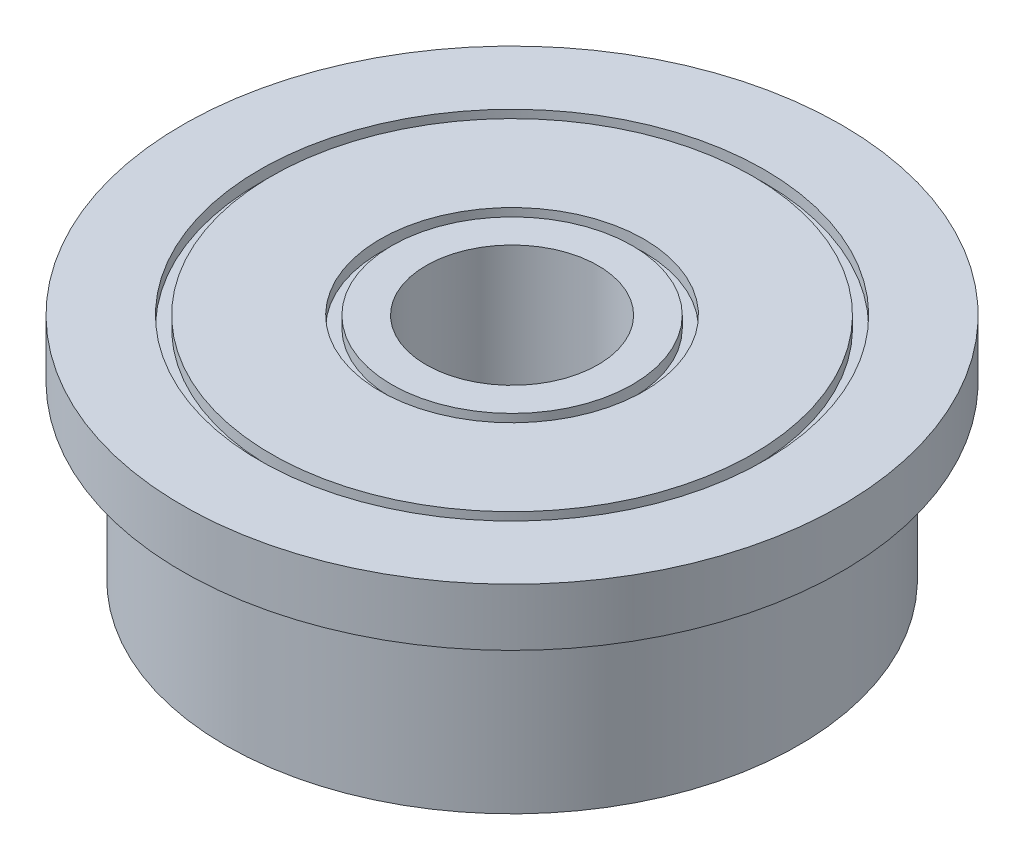
ISO-10303-21;
HEADER;
FILE_DESCRIPTION(('STEP AP214'),'2;1');
FILE_NAME('part.step','',(''),(''),'','','');
FILE_SCHEMA(('AUTOMOTIVE_DESIGN { 1 0 10303 214 1 1 1 1 }'));
ENDSEC;
DATA;
#1=APPLICATION_CONTEXT('core data for automotive mechanical design processes');
#2=APPLICATION_PROTOCOL_DEFINITION('international standard','automotive_design',2000,#1);
#3=PRODUCT_CONTEXT('',#1,'mechanical');
#4=PRODUCT('Part','Part','',(#3));
#5=PRODUCT_RELATED_PRODUCT_CATEGORY('part','',(#4));
#6=PRODUCT_DEFINITION_FORMATION('','',#4);
#7=PRODUCT_DEFINITION_CONTEXT('part definition',#1,'design');
#8=PRODUCT_DEFINITION('design','',#6,#7);
#9=PRODUCT_DEFINITION_SHAPE('','',#8);
#10=(LENGTH_UNIT() NAMED_UNIT(*) SI_UNIT(.MILLI.,.METRE.));
#11=(NAMED_UNIT(*) PLANE_ANGLE_UNIT() SI_UNIT($,.RADIAN.));
#12=(NAMED_UNIT(*) SI_UNIT($,.STERADIAN.) SOLID_ANGLE_UNIT());
#13=UNCERTAINTY_MEASURE_WITH_UNIT(LENGTH_MEASURE(1.E-05),#10,'distance_accuracy_value','');
#14=(GEOMETRIC_REPRESENTATION_CONTEXT(3) GLOBAL_UNCERTAINTY_ASSIGNED_CONTEXT((#13)) GLOBAL_UNIT_ASSIGNED_CONTEXT((#10,
#11,#12)) REPRESENTATION_CONTEXT('',''));
#15=CARTESIAN_POINT('',(0.,0.,0.));
#16=DIRECTION('',(0.,0.,1.));
#17=DIRECTION('',(1.,0.,0.));
#18=AXIS2_PLACEMENT_3D('',#15,#16,#17);
#19=CARTESIAN_POINT('',(0.,3.99999999999999,-5.75));
#20=DIRECTION('',(0.,1.,0.));
#21=DIRECTION('',(0.,0.,1.));
#22=AXIS2_PLACEMENT_3D('',#19,#20,#21);
#23=PLANE('',#22);
#24=CARTESIAN_POINT('',(0.,4.,0.));
#25=DIRECTION('',(0.,-1.,0.));
#26=DIRECTION('',(0.,0.,-1.));
#27=AXIS2_PLACEMENT_3D('',#24,#25,#26);
#28=CIRCLE('',#27,2.1);
#29=CARTESIAN_POINT('',(0.,4.,-2.1));
#30=VERTEX_POINT('',#29);
#31=EDGE_CURVE('E18',#30,#30,#28,.T.);
#32=ORIENTED_EDGE('',*,*,#31,.F.);
#33=EDGE_LOOP('',(#32));
#34=FACE_BOUND('',#33,.T.);
#35=CARTESIAN_POINT('',(0.,3.99999999999999,0.));
#36=DIRECTION('',(0.,1.,0.));
#37=DIRECTION('',(0.,0.,1.));
#38=AXIS2_PLACEMENT_3D('',#35,#36,#37);
#39=CIRCLE('',#38,1.5);
#40=CARTESIAN_POINT('',(0.,3.99999999999999,1.5));
#41=VERTEX_POINT('',#40);
#42=EDGE_CURVE('E82',#41,#41,#39,.F.);
#43=ORIENTED_EDGE('',*,*,#42,.T.);
#44=EDGE_LOOP('',(#43));
#45=FACE_BOUND('',#44,.T.);
#46=ADVANCED_FACE('F15',(#34,#45),#23,.T.);
#47=CARTESIAN_POINT('',(0.,0.,0.));
#48=DIRECTION('',(0.,-1.,0.));
#49=DIRECTION('',(0.,0.,-1.));
#50=AXIS2_PLACEMENT_3D('',#47,#48,#49);
#51=CYLINDRICAL_SURFACE('',#50,2.1);
#52=ORIENTED_EDGE('',*,*,#31,.T.);
#53=EDGE_LOOP('',(#52));
#54=FACE_BOUND('',#53,.T.);
#55=CARTESIAN_POINT('',(0.,3.8,0.));
#56=DIRECTION('',(0.,-1.,0.));
#57=DIRECTION('',(0.,0.,-1.));
#58=AXIS2_PLACEMENT_3D('',#55,#56,#57);
#59=CIRCLE('',#58,2.1);
#60=CARTESIAN_POINT('',(0.,3.8,-2.1));
#61=VERTEX_POINT('',#60);
#62=EDGE_CURVE('E80',#61,#61,#59,.F.);
#63=ORIENTED_EDGE('',*,*,#62,.T.);
#64=EDGE_LOOP('',(#63));
#65=FACE_BOUND('',#64,.T.);
#66=ADVANCED_FACE('F89',(#54,#65),#51,.T.);
#67=CARTESIAN_POINT('',(0.,0.,0.));
#68=DIRECTION('',(0.,1.,0.));
#69=DIRECTION('',(0.,0.,1.));
#70=AXIS2_PLACEMENT_3D('',#67,#68,#69);
#71=CYLINDRICAL_SURFACE('',#70,1.5);
#72=ORIENTED_EDGE('',*,*,#42,.F.);
#73=EDGE_LOOP('',(#72));
#74=FACE_BOUND('',#73,.T.);
#75=CARTESIAN_POINT('',(0.,0.,0.));
#76=DIRECTION('',(0.,1.,0.));
#77=DIRECTION('',(0.,0.,1.));
#78=AXIS2_PLACEMENT_3D('',#75,#76,#77);
#79=CIRCLE('',#78,1.5);
#80=CARTESIAN_POINT('',(0.,0.,1.5));
#81=VERTEX_POINT('',#80);
#82=EDGE_CURVE('E77',#81,#81,#79,.T.);
#83=ORIENTED_EDGE('',*,*,#82,.F.);
#84=EDGE_LOOP('',(#83));
#85=FACE_BOUND('',#84,.T.);
#86=ADVANCED_FACE('F97',(#74,#85),#71,.F.);
#87=CARTESIAN_POINT('',(0.,3.8,-2.1));
#88=DIRECTION('',(0.,-1.,0.));
#89=DIRECTION('',(0.,0.,-1.));
#90=AXIS2_PLACEMENT_3D('',#87,#88,#89);
#91=PLANE('',#90);
#92=CARTESIAN_POINT('',(0.,3.8,0.));
#93=DIRECTION('',(0.,-1.,0.));
#94=DIRECTION('',(0.,0.,-1.));
#95=AXIS2_PLACEMENT_3D('',#92,#93,#94);
#96=CIRCLE('',#95,2.3);
#97=CARTESIAN_POINT('',(0.,3.8,-2.3));
#98=VERTEX_POINT('',#97);
#99=EDGE_CURVE('E74',#98,#98,#96,.F.);
#100=ORIENTED_EDGE('',*,*,#99,.T.);
#101=EDGE_LOOP('',(#100));
#102=FACE_BOUND('',#101,.T.);
#103=ORIENTED_EDGE('',*,*,#62,.F.);
#104=EDGE_LOOP('',(#103));
#105=FACE_BOUND('',#104,.T.);
#106=ADVANCED_FACE('F172',(#102,#105),#91,.F.);
#107=CARTESIAN_POINT('',(0.,0.,0.));
#108=DIRECTION('',(0.,-1.,0.));
#109=DIRECTION('',(0.,0.,-1.));
#110=AXIS2_PLACEMENT_3D('',#107,#108,#109);
#111=PLANE('',#110);
#112=CARTESIAN_POINT('',(0.,0.,0.));
#113=DIRECTION('',(0.,-1.,0.));
#114=DIRECTION('',(0.,0.,-1.));
#115=AXIS2_PLACEMENT_3D('',#112,#113,#114);
#116=CIRCLE('',#115,2.1);
#117=CARTESIAN_POINT('',(0.,0.,-2.1));
#118=VERTEX_POINT('',#117);
#119=EDGE_CURVE('E71',#118,#118,#116,.F.);
#120=ORIENTED_EDGE('',*,*,#119,.F.);
#121=EDGE_LOOP('',(#120));
#122=FACE_BOUND('',#121,.T.);
#123=ORIENTED_EDGE('',*,*,#82,.T.);
#124=EDGE_LOOP('',(#123));
#125=FACE_BOUND('',#124,.T.);
#126=ADVANCED_FACE('F168',(#122,#125),#111,.T.);
#127=CARTESIAN_POINT('',(0.,0.,0.));
#128=DIRECTION('',(0.,-1.,0.));
#129=DIRECTION('',(0.,0.,-1.));
#130=AXIS2_PLACEMENT_3D('',#127,#128,#129);
#131=CYLINDRICAL_SURFACE('',#130,2.3);
#132=ORIENTED_EDGE('',*,*,#99,.F.);
#133=EDGE_LOOP('',(#132));
#134=FACE_BOUND('',#133,.T.);
#135=CARTESIAN_POINT('',(0.,4.,0.));
#136=DIRECTION('',(0.,-1.,0.));
#137=DIRECTION('',(0.,0.,-1.));
#138=AXIS2_PLACEMENT_3D('',#135,#136,#137);
#139=CIRCLE('',#138,2.3);
#140=CARTESIAN_POINT('',(0.,4.,-2.3));
#141=VERTEX_POINT('',#140);
#142=EDGE_CURVE('E68',#141,#141,#139,.T.);
#143=ORIENTED_EDGE('',*,*,#142,.F.);
#144=EDGE_LOOP('',(#143));
#145=FACE_BOUND('',#144,.T.);
#146=ADVANCED_FACE('F164',(#134,#145),#131,.F.);
#147=CARTESIAN_POINT('',(0.,0.,0.));
#148=DIRECTION('',(0.,-1.,0.));
#149=DIRECTION('',(0.,0.,-1.));
#150=AXIS2_PLACEMENT_3D('',#147,#148,#149);
#151=CYLINDRICAL_SURFACE('',#150,2.1);
#152=ORIENTED_EDGE('',*,*,#119,.T.);
#153=EDGE_LOOP('',(#152));
#154=FACE_BOUND('',#153,.T.);
#155=CARTESIAN_POINT('',(0.,0.2,0.));
#156=DIRECTION('',(0.,-1.,0.));
#157=DIRECTION('',(0.,0.,-1.));
#158=AXIS2_PLACEMENT_3D('',#155,#156,#157);
#159=CIRCLE('',#158,2.1);
#160=CARTESIAN_POINT('',(0.,0.2,-2.1));
#161=VERTEX_POINT('',#160);
#162=EDGE_CURVE('E65',#161,#161,#159,.T.);
#163=ORIENTED_EDGE('',*,*,#162,.T.);
#164=EDGE_LOOP('',(#163));
#165=FACE_BOUND('',#164,.T.);
#166=ADVANCED_FACE('F160',(#154,#165),#151,.T.);
#167=CARTESIAN_POINT('',(0.,3.99999999999999,-5.75));
#168=DIRECTION('',(0.,1.,0.));
#169=DIRECTION('',(0.,0.,1.));
#170=AXIS2_PLACEMENT_3D('',#167,#168,#169);
#171=PLANE('',#170);
#172=CARTESIAN_POINT('',(0.,4.,0.));
#173=DIRECTION('',(0.,-1.,0.));
#174=DIRECTION('',(0.,0.,-1.));
#175=AXIS2_PLACEMENT_3D('',#172,#173,#174);
#176=CIRCLE('',#175,4.2);
#177=CARTESIAN_POINT('',(0.,4.,-4.2));
#178=VERTEX_POINT('',#177);
#179=EDGE_CURVE('E62',#178,#178,#176,.T.);
#180=ORIENTED_EDGE('',*,*,#179,.F.);
#181=EDGE_LOOP('',(#180));
#182=FACE_BOUND('',#181,.T.);
#183=ORIENTED_EDGE('',*,*,#142,.T.);
#184=EDGE_LOOP('',(#183));
#185=FACE_BOUND('',#184,.T.);
#186=ADVANCED_FACE('F156',(#182,#185),#171,.T.);
#187=CARTESIAN_POINT('',(0.,0.2,-2.1));
#188=DIRECTION('',(0.,1.,0.));
#189=DIRECTION('',(0.,0.,1.));
#190=AXIS2_PLACEMENT_3D('',#187,#188,#189);
#191=PLANE('',#190);
#192=ORIENTED_EDGE('',*,*,#162,.F.);
#193=EDGE_LOOP('',(#192));
#194=FACE_BOUND('',#193,.T.);
#195=CARTESIAN_POINT('',(0.,0.2,0.));
#196=DIRECTION('',(0.,-1.,0.));
#197=DIRECTION('',(0.,0.,-1.));
#198=AXIS2_PLACEMENT_3D('',#195,#196,#197);
#199=CIRCLE('',#198,2.3);
#200=CARTESIAN_POINT('',(0.,0.2,-2.3));
#201=VERTEX_POINT('',#200);
#202=EDGE_CURVE('E59',#201,#201,#199,.T.);
#203=ORIENTED_EDGE('',*,*,#202,.T.);
#204=EDGE_LOOP('',(#203));
#205=FACE_BOUND('',#204,.T.);
#206=ADVANCED_FACE('F152',(#194,#205),#191,.F.);
#207=CARTESIAN_POINT('',(0.,0.,0.));
#208=DIRECTION('',(0.,-1.,0.));
#209=DIRECTION('',(0.,0.,-1.));
#210=AXIS2_PLACEMENT_3D('',#207,#208,#209);
#211=CYLINDRICAL_SURFACE('',#210,4.2);
#212=ORIENTED_EDGE('',*,*,#179,.T.);
#213=EDGE_LOOP('',(#212));
#214=FACE_BOUND('',#213,.T.);
#215=CARTESIAN_POINT('',(0.,3.8,0.));
#216=DIRECTION('',(0.,-1.,0.));
#217=DIRECTION('',(0.,0.,-1.));
#218=AXIS2_PLACEMENT_3D('',#215,#216,#217);
#219=CIRCLE('',#218,4.2);
#220=CARTESIAN_POINT('',(0.,3.8,-4.2));
#221=VERTEX_POINT('',#220);
#222=EDGE_CURVE('E56',#221,#221,#219,.F.);
#223=ORIENTED_EDGE('',*,*,#222,.T.);
#224=EDGE_LOOP('',(#223));
#225=FACE_BOUND('',#224,.T.);
#226=ADVANCED_FACE('F148',(#214,#225),#211,.T.);
#227=CARTESIAN_POINT('',(0.,0.,0.));
#228=DIRECTION('',(0.,-1.,0.));
#229=DIRECTION('',(0.,0.,-1.));
#230=AXIS2_PLACEMENT_3D('',#227,#228,#229);
#231=CYLINDRICAL_SURFACE('',#230,2.3);
#232=ORIENTED_EDGE('',*,*,#202,.F.);
#233=EDGE_LOOP('',(#232));
#234=FACE_BOUND('',#233,.T.);
#235=CARTESIAN_POINT('',(0.,0.,0.));
#236=DIRECTION('',(0.,-1.,0.));
#237=DIRECTION('',(0.,0.,-1.));
#238=AXIS2_PLACEMENT_3D('',#235,#236,#237);
#239=CIRCLE('',#238,2.3);
#240=CARTESIAN_POINT('',(0.,0.,-2.3));
#241=VERTEX_POINT('',#240);
#242=EDGE_CURVE('E53',#241,#241,#239,.F.);
#243=ORIENTED_EDGE('',*,*,#242,.F.);
#244=EDGE_LOOP('',(#243));
#245=FACE_BOUND('',#244,.T.);
#246=ADVANCED_FACE('F144',(#234,#245),#231,.F.);
#247=CARTESIAN_POINT('',(0.,3.8,-4.2));
#248=DIRECTION('',(0.,-1.,0.));
#249=DIRECTION('',(0.,0.,-1.));
#250=AXIS2_PLACEMENT_3D('',#247,#248,#249);
#251=PLANE('',#250);
#252=CARTESIAN_POINT('',(0.,3.8,0.));
#253=DIRECTION('',(0.,-1.,0.));
#254=DIRECTION('',(0.,0.,-1.));
#255=AXIS2_PLACEMENT_3D('',#252,#253,#254);
#256=CIRCLE('',#255,4.4);
#257=CARTESIAN_POINT('',(0.,3.8,-4.4));
#258=VERTEX_POINT('',#257);
#259=EDGE_CURVE('E50',#258,#258,#256,.F.);
#260=ORIENTED_EDGE('',*,*,#259,.T.);
#261=EDGE_LOOP('',(#260));
#262=FACE_BOUND('',#261,.T.);
#263=ORIENTED_EDGE('',*,*,#222,.F.);
#264=EDGE_LOOP('',(#263));
#265=FACE_BOUND('',#264,.T.);
#266=ADVANCED_FACE('F140',(#262,#265),#251,.F.);
#267=CARTESIAN_POINT('',(0.,0.,0.));
#268=DIRECTION('',(0.,-1.,0.));
#269=DIRECTION('',(0.,0.,-1.));
#270=AXIS2_PLACEMENT_3D('',#267,#268,#269);
#271=PLANE('',#270);
#272=ORIENTED_EDGE('',*,*,#242,.T.);
#273=EDGE_LOOP('',(#272));
#274=FACE_BOUND('',#273,.T.);
#275=CARTESIAN_POINT('',(0.,0.,0.));
#276=DIRECTION('',(0.,-1.,0.));
#277=DIRECTION('',(0.,0.,-1.));
#278=AXIS2_PLACEMENT_3D('',#275,#276,#277);
#279=CIRCLE('',#278,4.2);
#280=CARTESIAN_POINT('',(0.,0.,-4.2));
#281=VERTEX_POINT('',#280);
#282=EDGE_CURVE('E47',#281,#281,#279,.F.);
#283=ORIENTED_EDGE('',*,*,#282,.F.);
#284=EDGE_LOOP('',(#283));
#285=FACE_BOUND('',#284,.T.);
#286=ADVANCED_FACE('F136',(#274,#285),#271,.T.);
#287=CARTESIAN_POINT('',(0.,0.,0.));
#288=DIRECTION('',(0.,-1.,0.));
#289=DIRECTION('',(0.,0.,-1.));
#290=AXIS2_PLACEMENT_3D('',#287,#288,#289);
#291=CYLINDRICAL_SURFACE('',#290,4.4);
#292=ORIENTED_EDGE('',*,*,#259,.F.);
#293=EDGE_LOOP('',(#292));
#294=FACE_BOUND('',#293,.T.);
#295=CARTESIAN_POINT('',(0.,4.,0.));
#296=DIRECTION('',(0.,-1.,0.));
#297=DIRECTION('',(0.,0.,-1.));
#298=AXIS2_PLACEMENT_3D('',#295,#296,#297);
#299=CIRCLE('',#298,4.4);
#300=CARTESIAN_POINT('',(0.,4.,-4.4));
#301=VERTEX_POINT('',#300);
#302=EDGE_CURVE('E44',#301,#301,#299,.T.);
#303=ORIENTED_EDGE('',*,*,#302,.F.);
#304=EDGE_LOOP('',(#303));
#305=FACE_BOUND('',#304,.T.);
#306=ADVANCED_FACE('F132',(#294,#305),#291,.F.);
#307=CARTESIAN_POINT('',(0.,0.,0.));
#308=DIRECTION('',(0.,-1.,0.));
#309=DIRECTION('',(0.,0.,-1.));
#310=AXIS2_PLACEMENT_3D('',#307,#308,#309);
#311=CYLINDRICAL_SURFACE('',#310,4.2);
#312=ORIENTED_EDGE('',*,*,#282,.T.);
#313=EDGE_LOOP('',(#312));
#314=FACE_BOUND('',#313,.T.);
#315=CARTESIAN_POINT('',(0.,0.2,0.));
#316=DIRECTION('',(0.,-1.,0.));
#317=DIRECTION('',(0.,0.,-1.));
#318=AXIS2_PLACEMENT_3D('',#315,#316,#317);
#319=CIRCLE('',#318,4.2);
#320=CARTESIAN_POINT('',(0.,0.2,-4.2));
#321=VERTEX_POINT('',#320);
#322=EDGE_CURVE('E41',#321,#321,#319,.T.);
#323=ORIENTED_EDGE('',*,*,#322,.T.);
#324=EDGE_LOOP('',(#323));
#325=FACE_BOUND('',#324,.T.);
#326=ADVANCED_FACE('F128',(#314,#325),#311,.T.);
#327=CARTESIAN_POINT('',(0.,3.99999999999999,-5.75));
#328=DIRECTION('',(0.,1.,0.));
#329=DIRECTION('',(0.,0.,1.));
#330=AXIS2_PLACEMENT_3D('',#327,#328,#329);
#331=PLANE('',#330);
#332=ORIENTED_EDGE('',*,*,#302,.T.);
#333=EDGE_LOOP('',(#332));
#334=FACE_BOUND('',#333,.T.);
#335=CARTESIAN_POINT('',(0.,4.,0.));
#336=DIRECTION('',(0.,-1.,0.));
#337=DIRECTION('',(0.,0.,-1.));
#338=AXIS2_PLACEMENT_3D('',#335,#336,#337);
#339=CIRCLE('',#338,5.75);
#340=CARTESIAN_POINT('',(0.,4.,-5.75));
#341=VERTEX_POINT('',#340);
#342=EDGE_CURVE('E38',#341,#341,#339,.T.);
#343=ORIENTED_EDGE('',*,*,#342,.F.);
#344=EDGE_LOOP('',(#343));
#345=FACE_BOUND('',#344,.T.);
#346=ADVANCED_FACE('F124',(#334,#345),#331,.T.);
#347=CARTESIAN_POINT('',(0.,0.2,-4.2));
#348=DIRECTION('',(0.,1.,0.));
#349=DIRECTION('',(0.,0.,1.));
#350=AXIS2_PLACEMENT_3D('',#347,#348,#349);
#351=PLANE('',#350);
#352=ORIENTED_EDGE('',*,*,#322,.F.);
#353=EDGE_LOOP('',(#352));
#354=FACE_BOUND('',#353,.T.);
#355=CARTESIAN_POINT('',(0.,0.2,0.));
#356=DIRECTION('',(0.,-1.,0.));
#357=DIRECTION('',(0.,0.,-1.));
#358=AXIS2_PLACEMENT_3D('',#355,#356,#357);
#359=CIRCLE('',#358,4.4);
#360=CARTESIAN_POINT('',(0.,0.2,-4.4));
#361=VERTEX_POINT('',#360);
#362=EDGE_CURVE('E35',#361,#361,#359,.T.);
#363=ORIENTED_EDGE('',*,*,#362,.T.);
#364=EDGE_LOOP('',(#363));
#365=FACE_BOUND('',#364,.T.);
#366=ADVANCED_FACE('F120',(#354,#365),#351,.F.);
#367=CARTESIAN_POINT('',(0.,0.,0.));
#368=DIRECTION('',(0.,-1.,0.));
#369=DIRECTION('',(0.,0.,-1.));
#370=AXIS2_PLACEMENT_3D('',#367,#368,#369);
#371=CYLINDRICAL_SURFACE('',#370,5.75);
#372=ORIENTED_EDGE('',*,*,#342,.T.);
#373=EDGE_LOOP('',(#372));
#374=FACE_BOUND('',#373,.T.);
#375=CARTESIAN_POINT('',(0.,3.,0.));
#376=DIRECTION('',(0.,-1.,0.));
#377=DIRECTION('',(0.,0.,-1.));
#378=AXIS2_PLACEMENT_3D('',#375,#376,#377);
#379=CIRCLE('',#378,5.75);
#380=CARTESIAN_POINT('',(0.,3.,-5.75));
#381=VERTEX_POINT('',#380);
#382=EDGE_CURVE('E32',#381,#381,#379,.T.);
#383=ORIENTED_EDGE('',*,*,#382,.F.);
#384=EDGE_LOOP('',(#383));
#385=FACE_BOUND('',#384,.T.);
#386=ADVANCED_FACE('F116',(#374,#385),#371,.T.);
#387=CARTESIAN_POINT('',(0.,0.,0.));
#388=DIRECTION('',(0.,-1.,0.));
#389=DIRECTION('',(0.,0.,-1.));
#390=AXIS2_PLACEMENT_3D('',#387,#388,#389);
#391=CYLINDRICAL_SURFACE('',#390,4.4);
#392=ORIENTED_EDGE('',*,*,#362,.F.);
#393=EDGE_LOOP('',(#392));
#394=FACE_BOUND('',#393,.T.);
#395=CARTESIAN_POINT('',(0.,0.,0.));
#396=DIRECTION('',(0.,-1.,0.));
#397=DIRECTION('',(0.,0.,-1.));
#398=AXIS2_PLACEMENT_3D('',#395,#396,#397);
#399=CIRCLE('',#398,4.4);
#400=CARTESIAN_POINT('',(0.,0.,-4.4));
#401=VERTEX_POINT('',#400);
#402=EDGE_CURVE('E27',#401,#401,#399,.F.);
#403=ORIENTED_EDGE('',*,*,#402,.F.);
#404=EDGE_LOOP('',(#403));
#405=FACE_BOUND('',#404,.T.);
#406=ADVANCED_FACE('F112',(#394,#405),#391,.F.);
#407=CARTESIAN_POINT('',(0.,3.,-5.));
#408=DIRECTION('',(0.,-1.,0.));
#409=DIRECTION('',(0.,0.,-1.));
#410=AXIS2_PLACEMENT_3D('',#407,#408,#409);
#411=PLANE('',#410);
#412=ORIENTED_EDGE('',*,*,#382,.T.);
#413=EDGE_LOOP('',(#412));
#414=FACE_BOUND('',#413,.T.);
#415=CARTESIAN_POINT('',(0.,3.,0.));
#416=DIRECTION('',(0.,-1.,0.));
#417=DIRECTION('',(0.,0.,-1.));
#418=AXIS2_PLACEMENT_3D('',#415,#416,#417);
#419=CIRCLE('',#418,5.);
#420=CARTESIAN_POINT('',(0.,3.,-5.));
#421=VERTEX_POINT('',#420);
#422=EDGE_CURVE('E22',#421,#421,#419,.T.);
#423=ORIENTED_EDGE('',*,*,#422,.F.);
#424=EDGE_LOOP('',(#423));
#425=FACE_BOUND('',#424,.T.);
#426=ADVANCED_FACE('F105',(#414,#425),#411,.T.);
#427=CARTESIAN_POINT('',(0.,0.,0.));
#428=DIRECTION('',(0.,-1.,0.));
#429=DIRECTION('',(0.,0.,-1.));
#430=AXIS2_PLACEMENT_3D('',#427,#428,#429);
#431=PLANE('',#430);
#432=ORIENTED_EDGE('',*,*,#402,.T.);
#433=EDGE_LOOP('',(#432));
#434=FACE_BOUND('',#433,.T.);
#435=CARTESIAN_POINT('',(0.,0.,0.));
#436=DIRECTION('',(0.,-1.,0.));
#437=DIRECTION('',(0.,0.,-1.));
#438=AXIS2_PLACEMENT_3D('',#435,#436,#437);
#439=CIRCLE('',#438,5.);
#440=CARTESIAN_POINT('',(0.,0.,-5.));
#441=VERTEX_POINT('',#440);
#442=EDGE_CURVE('E10',#441,#441,#439,.F.);
#443=ORIENTED_EDGE('',*,*,#442,.F.);
#444=EDGE_LOOP('',(#443));
#445=FACE_BOUND('',#444,.T.);
#446=ADVANCED_FACE('F100',(#434,#445),#431,.T.);
#447=CARTESIAN_POINT('',(0.,0.,0.));
#448=DIRECTION('',(0.,-1.,0.));
#449=DIRECTION('',(0.,0.,-1.));
#450=AXIS2_PLACEMENT_3D('',#447,#448,#449);
#451=CYLINDRICAL_SURFACE('',#450,5.);
#452=ORIENTED_EDGE('',*,*,#442,.T.);
#453=EDGE_LOOP('',(#452));
#454=FACE_BOUND('',#453,.T.);
#455=ORIENTED_EDGE('',*,*,#422,.T.);
#456=EDGE_LOOP('',(#455));
#457=FACE_BOUND('',#456,.T.);
#458=ADVANCED_FACE('F98',(#454,#457),#451,.T.);
#459=CLOSED_SHELL('',(#46,#66,#86,#106,#126,#146,#166,#186,#206,#226,#246,#266,#286,#306,#326,
#346,#366,#386,#406,#426,#446,#458));
#460=MANIFOLD_SOLID_BREP('B1',#459);
#461=ADVANCED_BREP_SHAPE_REPRESENTATION('',(#18,#460),#14);
#462=SHAPE_DEFINITION_REPRESENTATION(#9,#461);
ENDSEC;
END-ISO-10303-21;
